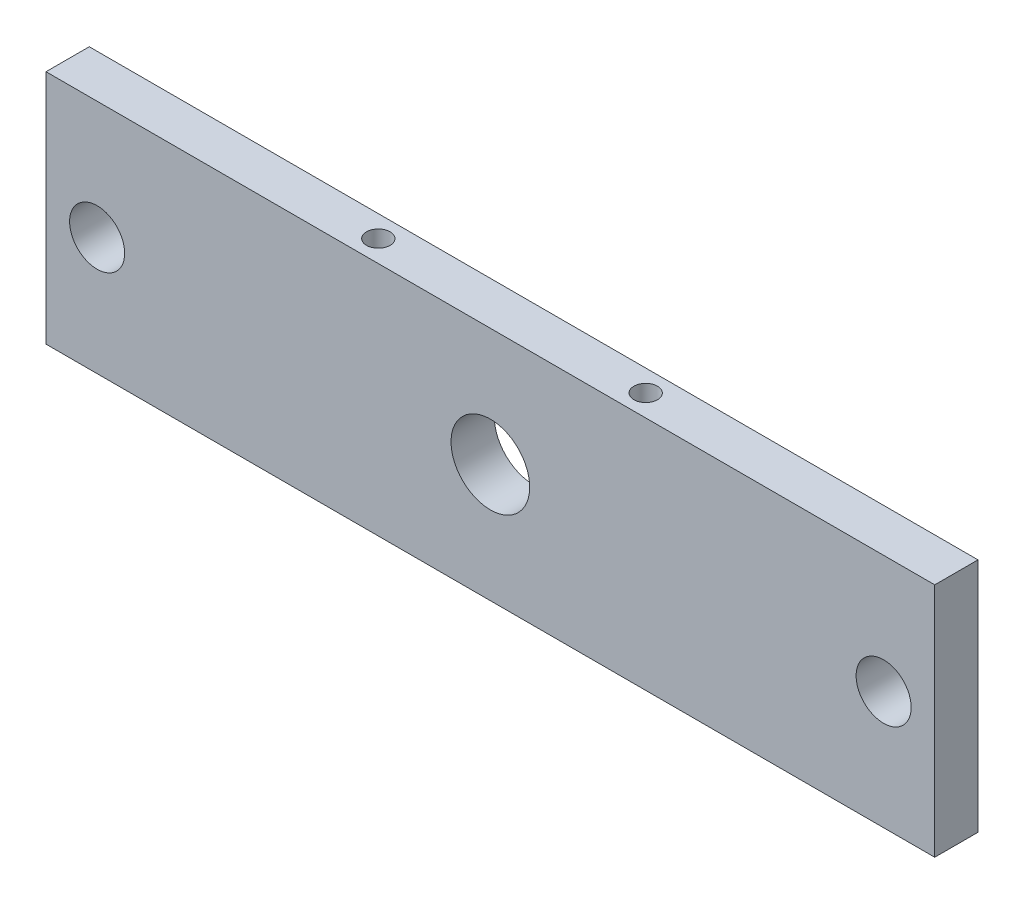
ISO-10303-21;
HEADER;
FILE_DESCRIPTION(('STEP AP214'),'2;1');
FILE_NAME('part.step','',(''),(''),'','','');
FILE_SCHEMA(('AUTOMOTIVE_DESIGN { 1 0 10303 214 1 1 1 1 }'));
ENDSEC;
DATA;
#1=APPLICATION_CONTEXT('core data for automotive mechanical design processes');
#2=APPLICATION_PROTOCOL_DEFINITION('international standard','automotive_design',2000,#1);
#3=PRODUCT_CONTEXT('',#1,'mechanical');
#4=PRODUCT('Part','Part','',(#3));
#5=PRODUCT_RELATED_PRODUCT_CATEGORY('part','',(#4));
#6=PRODUCT_DEFINITION_FORMATION('','',#4);
#7=PRODUCT_DEFINITION_CONTEXT('part definition',#1,'design');
#8=PRODUCT_DEFINITION('design','',#6,#7);
#9=PRODUCT_DEFINITION_SHAPE('','',#8);
#10=(LENGTH_UNIT() NAMED_UNIT(*) SI_UNIT(.MILLI.,.METRE.));
#11=(NAMED_UNIT(*) PLANE_ANGLE_UNIT() SI_UNIT($,.RADIAN.));
#12=(NAMED_UNIT(*) SI_UNIT($,.STERADIAN.) SOLID_ANGLE_UNIT());
#13=UNCERTAINTY_MEASURE_WITH_UNIT(LENGTH_MEASURE(1.E-05),#10,'distance_accuracy_value','');
#14=(GEOMETRIC_REPRESENTATION_CONTEXT(3) GLOBAL_UNCERTAINTY_ASSIGNED_CONTEXT((#13)) GLOBAL_UNIT_ASSIGNED_CONTEXT((#10,
#11,#12)) REPRESENTATION_CONTEXT('',''));
#15=CARTESIAN_POINT('',(0.,0.,0.));
#16=DIRECTION('',(0.,0.,1.));
#17=DIRECTION('',(1.,0.,0.));
#18=AXIS2_PLACEMENT_3D('',#15,#16,#17);
#19=CARTESIAN_POINT('',(0.,56.4516129032258,5.5));
#20=DIRECTION('',(0.,1.,0.));
#21=DIRECTION('',(-1.,0.,0.));
#22=AXIS2_PLACEMENT_3D('',#19,#20,#21);
#23=PLANE('',#22);
#24=CARTESIAN_POINT('',(-209.217741935484,56.4516129032258,2.75));
#25=DIRECTION('',(0.,1.,0.));
#26=DIRECTION('',(-1.,0.,0.));
#27=AXIS2_PLACEMENT_3D('',#24,#25,#26);
#28=CIRCLE('',#27,1.5);
#29=CARTESIAN_POINT('',(-210.717741935484,56.4516129032258,2.75));
#30=VERTEX_POINT('',#29);
#31=EDGE_CURVE('E115',#30,#30,#28,.F.);
#32=ORIENTED_EDGE('',*,*,#31,.T.);
#33=EDGE_LOOP('',(#32));
#34=FACE_BOUND('',#33,.T.);
#35=DIRECTION('',(1.,0.,0.));
#36=VECTOR('',#35,1.);
#37=CARTESIAN_POINT('',(0.,56.4516129032258,0.));
#38=LINE('',#37,#36);
#39=CARTESIAN_POINT('',(-248.717741935484,56.4516129032258,0.));
#40=VERTEX_POINT('',#39);
#41=CARTESIAN_POINT('',(-135.717741935484,56.4516129032258,0.));
#42=VERTEX_POINT('',#41);
#43=EDGE_CURVE('E87',#40,#42,#38,.T.);
#44=ORIENTED_EDGE('',*,*,#43,.F.);
#45=DIRECTION('',(0.,0.,-1.));
#46=VECTOR('',#45,1.);
#47=CARTESIAN_POINT('',(-248.717741935484,56.4516129032258,5.5));
#48=LINE('',#47,#46);
#49=CARTESIAN_POINT('',(-248.717741935484,56.4516129032258,5.5));
#50=VERTEX_POINT('',#49);
#51=EDGE_CURVE('E43',#50,#40,#48,.T.);
#52=ORIENTED_EDGE('',*,*,#51,.F.);
#53=DIRECTION('',(1.,0.,0.));
#54=VECTOR('',#53,1.);
#55=CARTESIAN_POINT('',(0.,56.4516129032258,5.5));
#56=LINE('',#55,#54);
#57=CARTESIAN_POINT('',(-135.717741935484,56.4516129032258,5.5));
#58=VERTEX_POINT('',#57);
#59=EDGE_CURVE('E85',#50,#58,#56,.T.);
#60=ORIENTED_EDGE('',*,*,#59,.T.);
#61=DIRECTION('',(0.,0.,-1.));
#62=VECTOR('',#61,1.);
#63=CARTESIAN_POINT('',(-135.717741935484,56.4516129032258,5.5));
#64=LINE('',#63,#62);
#65=EDGE_CURVE('E11',#58,#42,#64,.T.);
#66=ORIENTED_EDGE('',*,*,#65,.T.);
#67=EDGE_LOOP('',(#44,#52,#60,#66));
#68=FACE_BOUND('',#67,.T.);
#69=CARTESIAN_POINT('',(-175.217741935484,56.4516129032258,2.75));
#70=DIRECTION('',(0.,1.,0.));
#71=DIRECTION('',(-1.,0.,0.));
#72=AXIS2_PLACEMENT_3D('',#69,#70,#71);
#73=CIRCLE('',#72,1.5);
#74=CARTESIAN_POINT('',(-176.717741935484,56.4516129032258,2.75));
#75=VERTEX_POINT('',#74);
#76=EDGE_CURVE('E130',#75,#75,#73,.F.);
#77=ORIENTED_EDGE('',*,*,#76,.T.);
#78=EDGE_LOOP('',(#77));
#79=FACE_BOUND('',#78,.T.);
#80=ADVANCED_FACE('F33',(#34,#68,#79),#23,.T.);
#81=CARTESIAN_POINT('',(0.,26.4516129032258,5.5));
#82=DIRECTION('',(0.,1.,0.));
#83=DIRECTION('',(0.,0.,1.));
#84=AXIS2_PLACEMENT_3D('',#81,#82,#83);
#85=PLANE('',#84);
#86=CARTESIAN_POINT('',(-209.217741935484,26.4516129032258,2.75));
#87=DIRECTION('',(0.,1.,0.));
#88=DIRECTION('',(0.,0.,1.));
#89=AXIS2_PLACEMENT_3D('',#86,#87,#88);
#90=CIRCLE('',#89,1.5);
#91=CARTESIAN_POINT('',(-209.217741935484,26.4516129032258,4.25));
#92=VERTEX_POINT('',#91);
#93=EDGE_CURVE('E128',#92,#92,#90,.F.);
#94=ORIENTED_EDGE('',*,*,#93,.F.);
#95=EDGE_LOOP('',(#94));
#96=FACE_BOUND('',#95,.T.);
#97=DIRECTION('',(1.,0.,0.));
#98=VECTOR('',#97,1.);
#99=CARTESIAN_POINT('',(0.,26.4516129032258,0.));
#100=LINE('',#99,#98);
#101=CARTESIAN_POINT('',(-248.717741935484,26.4516129032258,0.));
#102=VERTEX_POINT('',#101);
#103=CARTESIAN_POINT('',(-135.717741935484,26.4516129032258,0.));
#104=VERTEX_POINT('',#103);
#105=EDGE_CURVE('E68',#102,#104,#100,.T.);
#106=ORIENTED_EDGE('',*,*,#105,.T.);
#107=DIRECTION('',(0.,0.,-1.));
#108=VECTOR('',#107,1.);
#109=CARTESIAN_POINT('',(-135.717741935484,26.4516129032258,5.5));
#110=LINE('',#109,#108);
#111=CARTESIAN_POINT('',(-135.717741935484,26.4516129032258,5.5));
#112=VERTEX_POINT('',#111);
#113=EDGE_CURVE('E75',#112,#104,#110,.T.);
#114=ORIENTED_EDGE('',*,*,#113,.F.);
#115=DIRECTION('',(1.,0.,0.));
#116=VECTOR('',#115,1.);
#117=CARTESIAN_POINT('',(0.,26.4516129032258,5.5));
#118=LINE('',#117,#116);
#119=CARTESIAN_POINT('',(-248.717741935484,26.4516129032258,5.5));
#120=VERTEX_POINT('',#119);
#121=EDGE_CURVE('E52',#120,#112,#118,.T.);
#122=ORIENTED_EDGE('',*,*,#121,.F.);
#123=DIRECTION('',(0.,0.,-1.));
#124=VECTOR('',#123,1.);
#125=CARTESIAN_POINT('',(-248.717741935484,26.4516129032258,5.5));
#126=LINE('',#125,#124);
#127=EDGE_CURVE('E90',#120,#102,#126,.T.);
#128=ORIENTED_EDGE('',*,*,#127,.T.);
#129=EDGE_LOOP('',(#106,#114,#122,#128));
#130=FACE_BOUND('',#129,.T.);
#131=CARTESIAN_POINT('',(-175.217741935484,26.4516129032258,2.75));
#132=DIRECTION('',(0.,1.,0.));
#133=DIRECTION('',(0.,0.,1.));
#134=AXIS2_PLACEMENT_3D('',#131,#132,#133);
#135=CIRCLE('',#134,1.5);
#136=CARTESIAN_POINT('',(-175.217741935484,26.4516129032258,4.25));
#137=VERTEX_POINT('',#136);
#138=EDGE_CURVE('E37',#137,#137,#135,.F.);
#139=ORIENTED_EDGE('',*,*,#138,.F.);
#140=EDGE_LOOP('',(#139));
#141=FACE_BOUND('',#140,.T.);
#142=ADVANCED_FACE('F159',(#96,#130,#141),#85,.F.);
#143=CARTESIAN_POINT('',(-135.717741935484,0.,5.5));
#144=DIRECTION('',(1.,0.,0.));
#145=DIRECTION('',(0.,0.,-1.));
#146=AXIS2_PLACEMENT_3D('',#143,#144,#145);
#147=PLANE('',#146);
#148=DIRECTION('',(0.,-1.,0.));
#149=VECTOR('',#148,1.);
#150=CARTESIAN_POINT('',(-135.717741935484,0.,0.));
#151=LINE('',#150,#149);
#152=EDGE_CURVE('E114',#42,#104,#151,.T.);
#153=ORIENTED_EDGE('',*,*,#152,.F.);
#154=ORIENTED_EDGE('',*,*,#65,.F.);
#155=DIRECTION('',(0.,-1.,0.));
#156=VECTOR('',#155,1.);
#157=CARTESIAN_POINT('',(-135.717741935484,0.,5.5));
#158=LINE('',#157,#156);
#159=EDGE_CURVE('E98',#58,#112,#158,.T.);
#160=ORIENTED_EDGE('',*,*,#159,.T.);
#161=ORIENTED_EDGE('',*,*,#113,.T.);
#162=EDGE_LOOP('',(#153,#154,#160,#161));
#163=FACE_BOUND('',#162,.T.);
#164=ADVANCED_FACE('F165',(#163),#147,.T.);
#165=CARTESIAN_POINT('',(-248.717741935484,0.,5.5));
#166=DIRECTION('',(1.,0.,0.));
#167=DIRECTION('',(0.,0.,-1.));
#168=AXIS2_PLACEMENT_3D('',#165,#166,#167);
#169=PLANE('',#168);
#170=DIRECTION('',(0.,-1.,0.));
#171=VECTOR('',#170,1.);
#172=CARTESIAN_POINT('',(-248.717741935484,0.,0.));
#173=LINE('',#172,#171);
#174=EDGE_CURVE('E118',#40,#102,#173,.T.);
#175=ORIENTED_EDGE('',*,*,#174,.T.);
#176=ORIENTED_EDGE('',*,*,#127,.F.);
#177=DIRECTION('',(0.,-1.,0.));
#178=VECTOR('',#177,1.);
#179=CARTESIAN_POINT('',(-248.717741935484,0.,5.5));
#180=LINE('',#179,#178);
#181=EDGE_CURVE('E93',#50,#120,#180,.T.);
#182=ORIENTED_EDGE('',*,*,#181,.F.);
#183=ORIENTED_EDGE('',*,*,#51,.T.);
#184=EDGE_LOOP('',(#175,#176,#182,#183));
#185=FACE_BOUND('',#184,.T.);
#186=ADVANCED_FACE('F94',(#185),#169,.F.);
#187=CARTESIAN_POINT('',(-242.217741935484,41.4516129032258,5.5));
#188=DIRECTION('',(0.,0.,-1.));
#189=DIRECTION('',(-1.,0.,0.));
#190=AXIS2_PLACEMENT_3D('',#187,#188,#189);
#191=CYLINDRICAL_SURFACE('',#190,3.49999999999999);
#192=CARTESIAN_POINT('',(-242.217741935484,41.4516129032258,5.5));
#193=DIRECTION('',(0.,0.,1.));
#194=DIRECTION('',(1.,0.,0.));
#195=AXIS2_PLACEMENT_3D('',#192,#193,#194);
#196=CIRCLE('',#195,3.49999999999999);
#197=CARTESIAN_POINT('',(-238.717741935484,41.4516129032258,5.5));
#198=VERTEX_POINT('',#197);
#199=EDGE_CURVE('E105',#198,#198,#196,.T.);
#200=ORIENTED_EDGE('',*,*,#199,.T.);
#201=EDGE_LOOP('',(#200));
#202=FACE_BOUND('',#201,.T.);
#203=CARTESIAN_POINT('',(-242.217741935484,41.4516129032258,0.));
#204=DIRECTION('',(0.,0.,1.));
#205=DIRECTION('',(1.,0.,0.));
#206=AXIS2_PLACEMENT_3D('',#203,#204,#205);
#207=CIRCLE('',#206,3.49999999999999);
#208=CARTESIAN_POINT('',(-238.717741935484,41.4516129032258,0.));
#209=VERTEX_POINT('',#208);
#210=EDGE_CURVE('E121',#209,#209,#207,.T.);
#211=ORIENTED_EDGE('',*,*,#210,.F.);
#212=EDGE_LOOP('',(#211));
#213=FACE_BOUND('',#212,.T.);
#214=ADVANCED_FACE('F173',(#202,#213),#191,.F.);
#215=CARTESIAN_POINT('',(-192.217741935484,41.4516129032258,5.5));
#216=DIRECTION('',(0.,0.,-1.));
#217=DIRECTION('',(-1.,0.,0.));
#218=AXIS2_PLACEMENT_3D('',#215,#216,#217);
#219=CYLINDRICAL_SURFACE('',#218,5.00000000000002);
#220=CARTESIAN_POINT('',(-192.217741935484,41.4516129032258,5.5));
#221=DIRECTION('',(0.,0.,1.));
#222=DIRECTION('',(1.,0.,0.));
#223=AXIS2_PLACEMENT_3D('',#220,#221,#222);
#224=CIRCLE('',#223,5.00000000000002);
#225=CARTESIAN_POINT('',(-187.217741935484,41.4516129032258,5.5));
#226=VERTEX_POINT('',#225);
#227=EDGE_CURVE('E100',#226,#226,#224,.T.);
#228=ORIENTED_EDGE('',*,*,#227,.T.);
#229=EDGE_LOOP('',(#228));
#230=FACE_BOUND('',#229,.T.);
#231=CARTESIAN_POINT('',(-192.217741935484,41.4516129032258,0.));
#232=DIRECTION('',(0.,0.,1.));
#233=DIRECTION('',(1.,0.,0.));
#234=AXIS2_PLACEMENT_3D('',#231,#232,#233);
#235=CIRCLE('',#234,5.00000000000002);
#236=CARTESIAN_POINT('',(-187.217741935484,41.4516129032258,0.));
#237=VERTEX_POINT('',#236);
#238=EDGE_CURVE('E111',#237,#237,#235,.T.);
#239=ORIENTED_EDGE('',*,*,#238,.F.);
#240=EDGE_LOOP('',(#239));
#241=FACE_BOUND('',#240,.T.);
#242=ADVANCED_FACE('F35',(#230,#241),#219,.F.);
#243=CARTESIAN_POINT('',(-142.217741935484,41.4516129032258,5.5));
#244=DIRECTION('',(0.,0.,-1.));
#245=DIRECTION('',(-1.,0.,0.));
#246=AXIS2_PLACEMENT_3D('',#243,#244,#245);
#247=CYLINDRICAL_SURFACE('',#246,3.49999999999999);
#248=CARTESIAN_POINT('',(-142.217741935484,41.4516129032258,5.5));
#249=DIRECTION('',(0.,0.,1.));
#250=DIRECTION('',(1.,0.,0.));
#251=AXIS2_PLACEMENT_3D('',#248,#249,#250);
#252=CIRCLE('',#251,3.49999999999999);
#253=CARTESIAN_POINT('',(-138.717741935484,41.4516129032258,5.5));
#254=VERTEX_POINT('',#253);
#255=EDGE_CURVE('E108',#254,#254,#252,.T.);
#256=ORIENTED_EDGE('',*,*,#255,.T.);
#257=EDGE_LOOP('',(#256));
#258=FACE_BOUND('',#257,.T.);
#259=CARTESIAN_POINT('',(-142.217741935484,41.4516129032258,0.));
#260=DIRECTION('',(0.,0.,1.));
#261=DIRECTION('',(1.,0.,0.));
#262=AXIS2_PLACEMENT_3D('',#259,#260,#261);
#263=CIRCLE('',#262,3.49999999999999);
#264=CARTESIAN_POINT('',(-138.717741935484,41.4516129032258,0.));
#265=VERTEX_POINT('',#264);
#266=EDGE_CURVE('E124',#265,#265,#263,.T.);
#267=ORIENTED_EDGE('',*,*,#266,.F.);
#268=EDGE_LOOP('',(#267));
#269=FACE_BOUND('',#268,.T.);
#270=ADVANCED_FACE('F146',(#258,#269),#247,.F.);
#271=CARTESIAN_POINT('',(0.,0.,5.5));
#272=DIRECTION('',(0.,0.,1.));
#273=DIRECTION('',(1.,0.,0.));
#274=AXIS2_PLACEMENT_3D('',#271,#272,#273);
#275=PLANE('',#274);
#276=ORIENTED_EDGE('',*,*,#227,.F.);
#277=EDGE_LOOP('',(#276));
#278=FACE_BOUND('',#277,.T.);
#279=ORIENTED_EDGE('',*,*,#159,.F.);
#280=ORIENTED_EDGE('',*,*,#59,.F.);
#281=ORIENTED_EDGE('',*,*,#181,.T.);
#282=ORIENTED_EDGE('',*,*,#121,.T.);
#283=EDGE_LOOP('',(#279,#280,#281,#282));
#284=FACE_BOUND('',#283,.T.);
#285=ORIENTED_EDGE('',*,*,#199,.F.);
#286=EDGE_LOOP('',(#285));
#287=FACE_BOUND('',#286,.T.);
#288=ORIENTED_EDGE('',*,*,#255,.F.);
#289=EDGE_LOOP('',(#288));
#290=FACE_BOUND('',#289,.T.);
#291=ADVANCED_FACE('F96',(#278,#284,#287,#290),#275,.T.);
#292=CARTESIAN_POINT('',(0.,0.,0.));
#293=DIRECTION('',(0.,0.,1.));
#294=DIRECTION('',(1.,0.,0.));
#295=AXIS2_PLACEMENT_3D('',#292,#293,#294);
#296=PLANE('',#295);
#297=ORIENTED_EDGE('',*,*,#238,.T.);
#298=EDGE_LOOP('',(#297));
#299=FACE_BOUND('',#298,.T.);
#300=ORIENTED_EDGE('',*,*,#152,.T.);
#301=ORIENTED_EDGE('',*,*,#105,.F.);
#302=ORIENTED_EDGE('',*,*,#174,.F.);
#303=ORIENTED_EDGE('',*,*,#43,.T.);
#304=EDGE_LOOP('',(#300,#301,#302,#303));
#305=FACE_BOUND('',#304,.T.);
#306=ORIENTED_EDGE('',*,*,#210,.T.);
#307=EDGE_LOOP('',(#306));
#308=FACE_BOUND('',#307,.T.);
#309=ORIENTED_EDGE('',*,*,#266,.T.);
#310=EDGE_LOOP('',(#309));
#311=FACE_BOUND('',#310,.T.);
#312=ADVANCED_FACE('F145',(#299,#305,#308,#311),#296,.F.);
#313=CARTESIAN_POINT('',(-209.217741935484,110.,2.75));
#314=DIRECTION('',(0.,-1.,0.));
#315=DIRECTION('',(0.,0.,-1.));
#316=AXIS2_PLACEMENT_3D('',#313,#314,#315);
#317=CYLINDRICAL_SURFACE('',#316,1.5);
#318=ORIENTED_EDGE('',*,*,#31,.F.);
#319=EDGE_LOOP('',(#318));
#320=FACE_BOUND('',#319,.T.);
#321=ORIENTED_EDGE('',*,*,#93,.T.);
#322=EDGE_LOOP('',(#321));
#323=FACE_BOUND('',#322,.T.);
#324=ADVANCED_FACE('F152',(#320,#323),#317,.F.);
#325=CARTESIAN_POINT('',(-175.217741935484,110.,2.75));
#326=DIRECTION('',(0.,-1.,0.));
#327=DIRECTION('',(0.,0.,-1.));
#328=AXIS2_PLACEMENT_3D('',#325,#326,#327);
#329=CYLINDRICAL_SURFACE('',#328,1.5);
#330=ORIENTED_EDGE('',*,*,#76,.F.);
#331=EDGE_LOOP('',(#330));
#332=FACE_BOUND('',#331,.T.);
#333=ORIENTED_EDGE('',*,*,#138,.T.);
#334=EDGE_LOOP('',(#333));
#335=FACE_BOUND('',#334,.T.);
#336=ADVANCED_FACE('F226',(#332,#335),#329,.F.);
#337=CLOSED_SHELL('',(#80,#142,#164,#186,#214,#242,#270,#291,#312,#324,#336));
#338=MANIFOLD_SOLID_BREP('B2',#337);
#339=ADVANCED_BREP_SHAPE_REPRESENTATION('',(#18,#338),#14);
#340=SHAPE_DEFINITION_REPRESENTATION(#9,#339);
ENDSEC;
END-ISO-10303-21;
